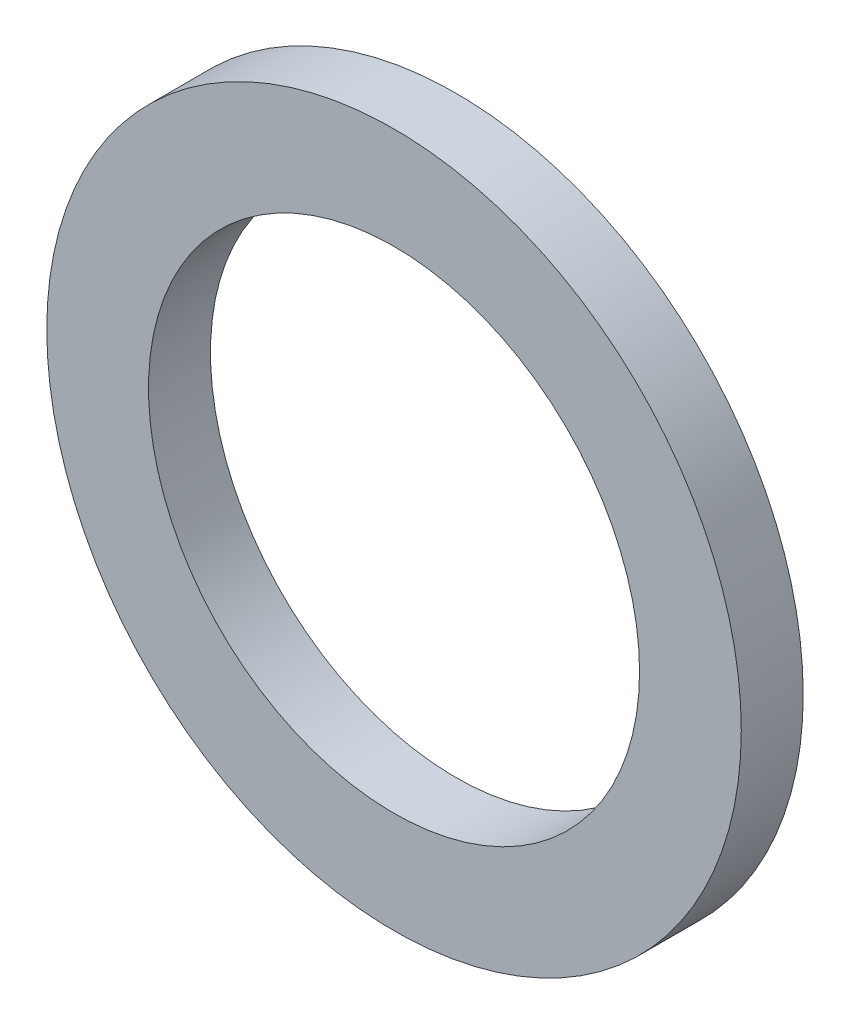
ISO-10303-21;
HEADER;
FILE_DESCRIPTION(('STEP AP214'),'2;1');
FILE_NAME('part.step','',(''),(''),'','','');
FILE_SCHEMA(('AUTOMOTIVE_DESIGN { 1 0 10303 214 1 1 1 1 }'));
ENDSEC;
DATA;
#1=APPLICATION_CONTEXT('core data for automotive mechanical design processes');
#2=APPLICATION_PROTOCOL_DEFINITION('international standard','automotive_design',2000,#1);
#3=PRODUCT_CONTEXT('',#1,'mechanical');
#4=PRODUCT('Part','Part','',(#3));
#5=PRODUCT_RELATED_PRODUCT_CATEGORY('part','',(#4));
#6=PRODUCT_DEFINITION_FORMATION('','',#4);
#7=PRODUCT_DEFINITION_CONTEXT('part definition',#1,'design');
#8=PRODUCT_DEFINITION('design','',#6,#7);
#9=PRODUCT_DEFINITION_SHAPE('','',#8);
#10=(LENGTH_UNIT() NAMED_UNIT(*) SI_UNIT(.MILLI.,.METRE.));
#11=(NAMED_UNIT(*) PLANE_ANGLE_UNIT() SI_UNIT($,.RADIAN.));
#12=(NAMED_UNIT(*) SI_UNIT($,.STERADIAN.) SOLID_ANGLE_UNIT());
#13=UNCERTAINTY_MEASURE_WITH_UNIT(LENGTH_MEASURE(1.E-05),#10,'distance_accuracy_value','');
#14=(GEOMETRIC_REPRESENTATION_CONTEXT(3) GLOBAL_UNCERTAINTY_ASSIGNED_CONTEXT((#13)) GLOBAL_UNIT_ASSIGNED_CONTEXT((#10,
#11,#12)) REPRESENTATION_CONTEXT('',''));
#15=CARTESIAN_POINT('',(0.,0.,0.));
#16=DIRECTION('',(0.,0.,1.));
#17=DIRECTION('',(1.,0.,0.));
#18=AXIS2_PLACEMENT_3D('',#15,#16,#17);
#19=CARTESIAN_POINT('',(0.,0.,1.4));
#20=DIRECTION('',(0.,0.,1.));
#21=DIRECTION('',(1.,0.,0.));
#22=AXIS2_PLACEMENT_3D('',#19,#20,#21);
#23=PLANE('',#22);
#24=CARTESIAN_POINT('',(0.,0.,1.4));
#25=DIRECTION('',(0.,0.,1.));
#26=DIRECTION('',(1.,0.,0.));
#27=AXIS2_PLACEMENT_3D('',#24,#25,#26);
#28=CIRCLE('',#27,7.85);
#29=CARTESIAN_POINT('',(7.85,0.,1.4));
#30=VERTEX_POINT('',#29);
#31=EDGE_CURVE('E10',#30,#30,#28,.T.);
#32=ORIENTED_EDGE('',*,*,#31,.T.);
#33=EDGE_LOOP('',(#32));
#34=FACE_BOUND('',#33,.T.);
#35=CARTESIAN_POINT('',(0.,0.,1.4));
#36=DIRECTION('',(0.,0.,1.));
#37=DIRECTION('',(1.,0.,0.));
#38=AXIS2_PLACEMENT_3D('',#35,#36,#37);
#39=CIRCLE('',#38,5.55);
#40=CARTESIAN_POINT('',(5.55,0.,1.4));
#41=VERTEX_POINT('',#40);
#42=EDGE_CURVE('E46',#41,#41,#39,.T.);
#43=ORIENTED_EDGE('',*,*,#42,.F.);
#44=EDGE_LOOP('',(#43));
#45=FACE_BOUND('',#44,.T.);
#46=ADVANCED_FACE('F35',(#34,#45),#23,.T.);
#47=CARTESIAN_POINT('',(0.,0.,0.));
#48=DIRECTION('',(0.,0.,1.));
#49=DIRECTION('',(1.,0.,0.));
#50=AXIS2_PLACEMENT_3D('',#47,#48,#49);
#51=PLANE('',#50);
#52=CARTESIAN_POINT('',(0.,0.,0.));
#53=DIRECTION('',(0.,0.,1.));
#54=DIRECTION('',(1.,0.,0.));
#55=AXIS2_PLACEMENT_3D('',#52,#53,#54);
#56=CIRCLE('',#55,7.85);
#57=CARTESIAN_POINT('',(7.85,0.,0.));
#58=VERTEX_POINT('',#57);
#59=EDGE_CURVE('E39',#58,#58,#56,.T.);
#60=ORIENTED_EDGE('',*,*,#59,.F.);
#61=EDGE_LOOP('',(#60));
#62=FACE_BOUND('',#61,.T.);
#63=CARTESIAN_POINT('',(0.,0.,0.));
#64=DIRECTION('',(0.,0.,1.));
#65=DIRECTION('',(1.,0.,0.));
#66=AXIS2_PLACEMENT_3D('',#63,#64,#65);
#67=CIRCLE('',#66,5.55);
#68=CARTESIAN_POINT('',(5.55,0.,0.));
#69=VERTEX_POINT('',#68);
#70=EDGE_CURVE('E48',#69,#69,#67,.T.);
#71=ORIENTED_EDGE('',*,*,#70,.T.);
#72=EDGE_LOOP('',(#71));
#73=FACE_BOUND('',#72,.T.);
#74=ADVANCED_FACE('F58',(#62,#73),#51,.F.);
#75=CARTESIAN_POINT('',(0.,0.,1.4));
#76=DIRECTION('',(0.,0.,-1.));
#77=DIRECTION('',(-1.,0.,0.));
#78=AXIS2_PLACEMENT_3D('',#75,#76,#77);
#79=CYLINDRICAL_SURFACE('',#78,7.85);
#80=ORIENTED_EDGE('',*,*,#31,.F.);
#81=EDGE_LOOP('',(#80));
#82=FACE_BOUND('',#81,.T.);
#83=ORIENTED_EDGE('',*,*,#59,.T.);
#84=EDGE_LOOP('',(#83));
#85=FACE_BOUND('',#84,.T.);
#86=ADVANCED_FACE('F37',(#82,#85),#79,.T.);
#87=CARTESIAN_POINT('',(0.,0.,1.4));
#88=DIRECTION('',(0.,0.,-1.));
#89=DIRECTION('',(-1.,0.,0.));
#90=AXIS2_PLACEMENT_3D('',#87,#88,#89);
#91=CYLINDRICAL_SURFACE('',#90,5.55);
#92=ORIENTED_EDGE('',*,*,#42,.T.);
#93=EDGE_LOOP('',(#92));
#94=FACE_BOUND('',#93,.T.);
#95=ORIENTED_EDGE('',*,*,#70,.F.);
#96=EDGE_LOOP('',(#95));
#97=FACE_BOUND('',#96,.T.);
#98=ADVANCED_FACE('F54',(#94,#97),#91,.F.);
#99=CLOSED_SHELL('',(#46,#74,#86,#98));
#100=MANIFOLD_SOLID_BREP('B2',#99);
#101=ADVANCED_BREP_SHAPE_REPRESENTATION('',(#18,#100),#14);
#102=SHAPE_DEFINITION_REPRESENTATION(#9,#101);
ENDSEC;
END-ISO-10303-21;
